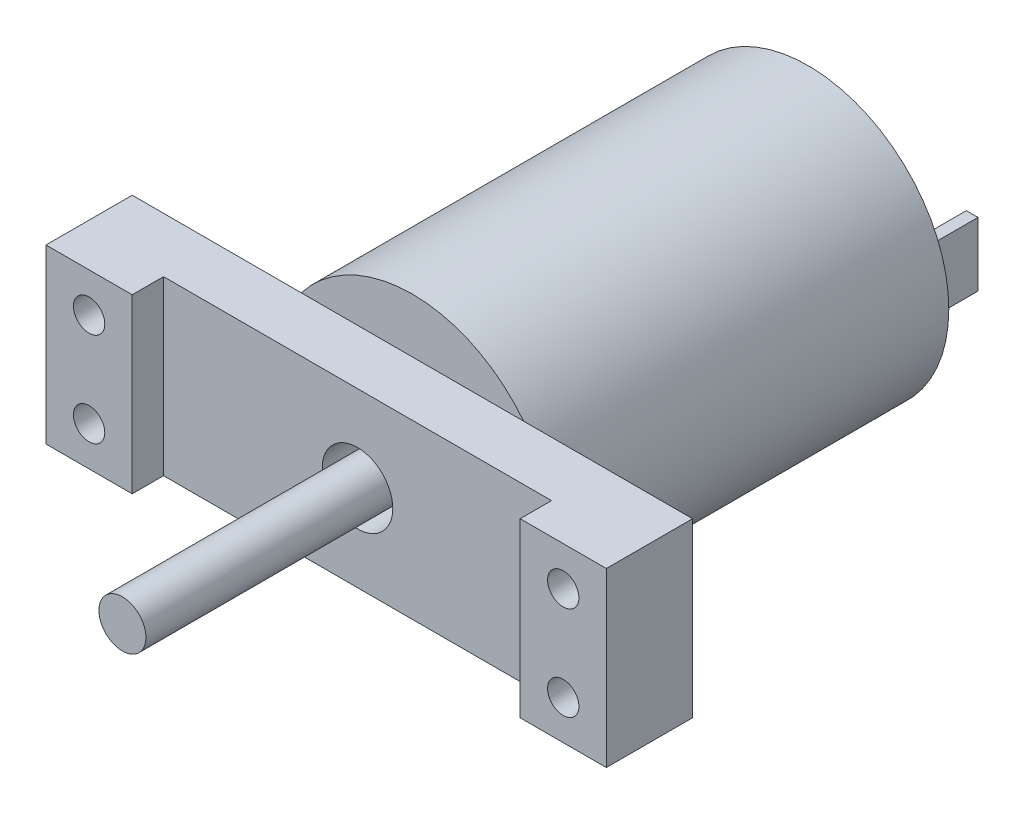
ISO-10303-21;
HEADER;
FILE_DESCRIPTION(('STEP AP214'),'2;1');
FILE_NAME('part.step','',(''),(''),'','','');
FILE_SCHEMA(('AUTOMOTIVE_DESIGN { 1 0 10303 214 1 1 1 1 }'));
ENDSEC;
DATA;
#1=APPLICATION_CONTEXT('core data for automotive mechanical design processes');
#2=APPLICATION_PROTOCOL_DEFINITION('international standard','automotive_design',2000,#1);
#3=PRODUCT_CONTEXT('',#1,'mechanical');
#4=PRODUCT('Part','Part','',(#3));
#5=PRODUCT_RELATED_PRODUCT_CATEGORY('part','',(#4));
#6=PRODUCT_DEFINITION_FORMATION('','',#4);
#7=PRODUCT_DEFINITION_CONTEXT('part definition',#1,'design');
#8=PRODUCT_DEFINITION('design','',#6,#7);
#9=PRODUCT_DEFINITION_SHAPE('','',#8);
#10=(LENGTH_UNIT() NAMED_UNIT(*) SI_UNIT(.MILLI.,.METRE.));
#11=(NAMED_UNIT(*) PLANE_ANGLE_UNIT() SI_UNIT($,.RADIAN.));
#12=(NAMED_UNIT(*) SI_UNIT($,.STERADIAN.) SOLID_ANGLE_UNIT());
#13=UNCERTAINTY_MEASURE_WITH_UNIT(LENGTH_MEASURE(1.E-05),#10,'distance_accuracy_value','');
#14=(GEOMETRIC_REPRESENTATION_CONTEXT(3) GLOBAL_UNCERTAINTY_ASSIGNED_CONTEXT((#13)) GLOBAL_UNIT_ASSIGNED_CONTEXT((#10,
#11,#12)) REPRESENTATION_CONTEXT('',''));
#15=CARTESIAN_POINT('',(0.,0.,0.));
#16=DIRECTION('',(0.,0.,1.));
#17=DIRECTION('',(1.,0.,0.));
#18=AXIS2_PLACEMENT_3D('',#15,#16,#17);
#19=CARTESIAN_POINT('',(0.,0.,0.));
#20=DIRECTION('',(0.,0.,1.));
#21=DIRECTION('',(1.,0.,0.));
#22=AXIS2_PLACEMENT_3D('',#19,#20,#21);
#23=PLANE('',#22);
#24=DIRECTION('',(0.,-1.,0.));
#25=VECTOR('',#24,1.);
#26=CARTESIAN_POINT('',(14.674642842713,5.01006528771067,0.));
#27=LINE('',#26,#25);
#28=CARTESIAN_POINT('',(14.674642842713,5.01006528771067,0.));
#29=VERTEX_POINT('',#28);
#30=CARTESIAN_POINT('',(14.674642842713,-3.1353311800507,0.));
#31=VERTEX_POINT('',#30);
#32=EDGE_CURVE('E179',#29,#31,#27,.T.);
#33=ORIENTED_EDGE('',*,*,#32,.F.);
#34=DIRECTION('',(1.,0.,0.));
#35=VECTOR('',#34,1.);
#36=CARTESIAN_POINT('',(14.674642842713,5.01006528771067,0.));
#37=LINE('',#36,#35);
#38=CARTESIAN_POINT('',(13.1877847573279,5.01006528771067,0.));
#39=VERTEX_POINT('',#38);
#40=EDGE_CURVE('E192',#39,#29,#37,.T.);
#41=ORIENTED_EDGE('',*,*,#40,.F.);
#42=DIRECTION('',(0.,1.,0.));
#43=VECTOR('',#42,1.);
#44=CARTESIAN_POINT('',(13.1877847573279,5.01006528771067,0.));
#45=LINE('',#44,#43);
#46=CARTESIAN_POINT('',(13.1877847573279,-3.1353311800507,0.));
#47=VERTEX_POINT('',#46);
#48=EDGE_CURVE('E201',#47,#39,#45,.T.);
#49=ORIENTED_EDGE('',*,*,#48,.F.);
#50=DIRECTION('',(-1.,0.,0.));
#51=VECTOR('',#50,1.);
#52=CARTESIAN_POINT('',(14.674642842713,-3.1353311800507,0.));
#53=LINE('',#52,#51);
#54=EDGE_CURVE('E182',#31,#47,#53,.T.);
#55=ORIENTED_EDGE('',*,*,#54,.F.);
#56=EDGE_LOOP('',(#33,#41,#49,#55));
#57=FACE_BOUND('',#56,.T.);
#58=CARTESIAN_POINT('',(0.,0.,0.));
#59=DIRECTION('',(0.,0.,1.));
#60=DIRECTION('',(1.,0.,0.));
#61=AXIS2_PLACEMENT_3D('',#58,#59,#60);
#62=CIRCLE('',#61,17.95);
#63=CARTESIAN_POINT('',(17.95,0.,0.));
#64=VERTEX_POINT('',#63);
#65=EDGE_CURVE('E313',#64,#64,#62,.T.);
#66=ORIENTED_EDGE('',*,*,#65,.F.);
#67=EDGE_LOOP('',(#66));
#68=FACE_BOUND('',#67,.T.);
#69=DIRECTION('',(0.,-1.,0.));
#70=VECTOR('',#69,1.);
#71=CARTESIAN_POINT('',(-12.1534486979297,5.01006528771067,0.));
#72=LINE('',#71,#70);
#73=CARTESIAN_POINT('',(-12.1534486979297,5.01006528771067,0.));
#74=VERTEX_POINT('',#73);
#75=CARTESIAN_POINT('',(-12.1534486979297,-3.1353311800507,0.));
#76=VERTEX_POINT('',#75);
#77=EDGE_CURVE('E178',#74,#76,#72,.T.);
#78=ORIENTED_EDGE('',*,*,#77,.F.);
#79=DIRECTION('',(1.,0.,0.));
#80=VECTOR('',#79,1.);
#81=CARTESIAN_POINT('',(-12.1534486979297,5.01006528771067,0.));
#82=LINE('',#81,#80);
#83=CARTESIAN_POINT('',(-14.028182805589,5.01006528771067,0.));
#84=VERTEX_POINT('',#83);
#85=EDGE_CURVE('E175',#84,#74,#82,.T.);
#86=ORIENTED_EDGE('',*,*,#85,.F.);
#87=DIRECTION('',(0.,1.,0.));
#88=VECTOR('',#87,1.);
#89=CARTESIAN_POINT('',(-14.028182805589,5.01006528771067,0.));
#90=LINE('',#89,#88);
#91=CARTESIAN_POINT('',(-14.028182805589,-3.1353311800507,0.));
#92=VERTEX_POINT('',#91);
#93=EDGE_CURVE('E53',#92,#84,#90,.T.);
#94=ORIENTED_EDGE('',*,*,#93,.F.);
#95=DIRECTION('',(-1.,0.,0.));
#96=VECTOR('',#95,1.);
#97=CARTESIAN_POINT('',(-12.1534486979297,-3.1353311800507,0.));
#98=LINE('',#97,#96);
#99=EDGE_CURVE('E48',#76,#92,#98,.T.);
#100=ORIENTED_EDGE('',*,*,#99,.F.);
#101=EDGE_LOOP('',(#78,#86,#94,#100));
#102=FACE_BOUND('',#101,.T.);
#103=ADVANCED_FACE('F33',(#57,#68,#102),#23,.F.);
#104=CARTESIAN_POINT('',(0.,0.,57.5));
#105=DIRECTION('',(0.,0.,-1.));
#106=DIRECTION('',(-1.,0.,0.));
#107=AXIS2_PLACEMENT_3D('',#104,#105,#106);
#108=PLANE('',#107);
#109=CARTESIAN_POINT('',(0.,0.,57.5));
#110=DIRECTION('',(0.,0.,1.));
#111=DIRECTION('',(1.,0.,0.));
#112=AXIS2_PLACEMENT_3D('',#109,#110,#111);
#113=CIRCLE('',#112,4.5);
#114=CARTESIAN_POINT('',(4.5,0.,57.5));
#115=VERTEX_POINT('',#114);
#116=EDGE_CURVE('E279',#115,#115,#113,.T.);
#117=ORIENTED_EDGE('',*,*,#116,.F.);
#118=EDGE_LOOP('',(#117));
#119=FACE_BOUND('',#118,.T.);
#120=DIRECTION('',(0.,-1.,0.));
#121=VECTOR('',#120,1.);
#122=CARTESIAN_POINT('',(24.75,11.,57.5));
#123=LINE('',#122,#121);
#124=CARTESIAN_POINT('',(24.75,11.,57.5));
#125=VERTEX_POINT('',#124);
#126=CARTESIAN_POINT('',(24.75,-11.,57.5));
#127=VERTEX_POINT('',#126);
#128=EDGE_CURVE('E241',#125,#127,#123,.T.);
#129=ORIENTED_EDGE('',*,*,#128,.F.);
#130=DIRECTION('',(-1.,0.,0.));
#131=VECTOR('',#130,1.);
#132=CARTESIAN_POINT('',(-35.75,11.,57.5));
#133=LINE('',#132,#131);
#134=CARTESIAN_POINT('',(-24.75,11.,57.5));
#135=VERTEX_POINT('',#134);
#136=EDGE_CURVE('E285',#125,#135,#133,.T.);
#137=ORIENTED_EDGE('',*,*,#136,.T.);
#138=DIRECTION('',(0.,1.,0.));
#139=VECTOR('',#138,1.);
#140=CARTESIAN_POINT('',(-24.75,11.,57.5));
#141=LINE('',#140,#139);
#142=CARTESIAN_POINT('',(-24.75,-11.,57.5));
#143=VERTEX_POINT('',#142);
#144=EDGE_CURVE('E260',#143,#135,#141,.T.);
#145=ORIENTED_EDGE('',*,*,#144,.F.);
#146=DIRECTION('',(1.,0.,0.));
#147=VECTOR('',#146,1.);
#148=CARTESIAN_POINT('',(-35.75,-11.,57.5));
#149=LINE('',#148,#147);
#150=EDGE_CURVE('E283',#143,#127,#149,.T.);
#151=ORIENTED_EDGE('',*,*,#150,.T.);
#152=EDGE_LOOP('',(#129,#137,#145,#151));
#153=FACE_BOUND('',#152,.T.);
#154=ADVANCED_FACE('F364',(#119,#153),#108,.F.);
#155=CARTESIAN_POINT('',(0.,0.,50.5));
#156=DIRECTION('',(0.,0.,1.));
#157=DIRECTION('',(1.,0.,0.));
#158=AXIS2_PLACEMENT_3D('',#155,#156,#157);
#159=PLANE('',#158);
#160=CARTESIAN_POINT('',(0.,0.,50.5));
#161=DIRECTION('',(0.,0.,1.));
#162=DIRECTION('',(1.,0.,0.));
#163=AXIS2_PLACEMENT_3D('',#160,#161,#162);
#164=CIRCLE('',#163,3.);
#165=CARTESIAN_POINT('',(3.,0.,50.5));
#166=VERTEX_POINT('',#165);
#167=EDGE_CURVE('E314',#166,#166,#164,.T.);
#168=ORIENTED_EDGE('',*,*,#167,.F.);
#169=EDGE_LOOP('',(#168));
#170=FACE_BOUND('',#169,.T.);
#171=CARTESIAN_POINT('',(0.,0.,50.5));
#172=DIRECTION('',(0.,0.,1.));
#173=DIRECTION('',(1.,0.,0.));
#174=AXIS2_PLACEMENT_3D('',#171,#172,#173);
#175=CIRCLE('',#174,4.5);
#176=CARTESIAN_POINT('',(4.5,0.,50.5));
#177=VERTEX_POINT('',#176);
#178=EDGE_CURVE('E317',#177,#177,#175,.F.);
#179=ORIENTED_EDGE('',*,*,#178,.F.);
#180=EDGE_LOOP('',(#179));
#181=FACE_BOUND('',#180,.T.);
#182=ADVANCED_FACE('F353',(#170,#181),#159,.T.);
#183=CARTESIAN_POINT('',(0.,0.,87.5));
#184=DIRECTION('',(0.,0.,-1.));
#185=DIRECTION('',(-1.,0.,0.));
#186=AXIS2_PLACEMENT_3D('',#183,#184,#185);
#187=CYLINDRICAL_SURFACE('',#186,3.);
#188=CARTESIAN_POINT('',(0.,0.,87.5));
#189=DIRECTION('',(0.,0.,1.));
#190=DIRECTION('',(1.,0.,0.));
#191=AXIS2_PLACEMENT_3D('',#188,#189,#190);
#192=CIRCLE('',#191,3.);
#193=CARTESIAN_POINT('',(3.,0.,87.5));
#194=VERTEX_POINT('',#193);
#195=EDGE_CURVE('E310',#194,#194,#192,.T.);
#196=ORIENTED_EDGE('',*,*,#195,.F.);
#197=EDGE_LOOP('',(#196));
#198=FACE_BOUND('',#197,.T.);
#199=ORIENTED_EDGE('',*,*,#167,.T.);
#200=EDGE_LOOP('',(#199));
#201=FACE_BOUND('',#200,.T.);
#202=ADVANCED_FACE('F363',(#198,#201),#187,.T.);
#203=CARTESIAN_POINT('',(0.,0.,87.5));
#204=DIRECTION('',(0.,0.,1.));
#205=DIRECTION('',(1.,0.,0.));
#206=AXIS2_PLACEMENT_3D('',#203,#204,#205);
#207=PLANE('',#206);
#208=ORIENTED_EDGE('',*,*,#195,.T.);
#209=EDGE_LOOP('',(#208));
#210=FACE_BOUND('',#209,.T.);
#211=ADVANCED_FACE('F470',(#210),#207,.T.);
#212=CARTESIAN_POINT('',(0.,0.,50.5));
#213=DIRECTION('',(0.,0.,-1.));
#214=DIRECTION('',(-1.,0.,0.));
#215=AXIS2_PLACEMENT_3D('',#212,#213,#214);
#216=PLANE('',#215);
#217=CARTESIAN_POINT('',(30.25,6.,50.5));
#218=DIRECTION('',(0.,0.,-1.));
#219=DIRECTION('',(-1.,0.,0.));
#220=AXIS2_PLACEMENT_3D('',#217,#218,#219);
#221=CIRCLE('',#220,2.);
#222=CARTESIAN_POINT('',(28.25,6.,50.5));
#223=VERTEX_POINT('',#222);
#224=EDGE_CURVE('E229',#223,#223,#221,.F.);
#225=ORIENTED_EDGE('',*,*,#224,.T.);
#226=EDGE_LOOP('',(#225));
#227=FACE_BOUND('',#226,.T.);
#228=CARTESIAN_POINT('',(30.25,-6.,50.5));
#229=DIRECTION('',(0.,0.,-1.));
#230=DIRECTION('',(-1.,0.,0.));
#231=AXIS2_PLACEMENT_3D('',#228,#229,#230);
#232=CIRCLE('',#231,2.);
#233=CARTESIAN_POINT('',(28.25,-6.,50.5));
#234=VERTEX_POINT('',#233);
#235=EDGE_CURVE('E222',#234,#234,#232,.F.);
#236=ORIENTED_EDGE('',*,*,#235,.T.);
#237=EDGE_LOOP('',(#236));
#238=FACE_BOUND('',#237,.T.);
#239=CARTESIAN_POINT('',(0.,0.,50.5));
#240=DIRECTION('',(0.,0.,1.));
#241=DIRECTION('',(1.,0.,0.));
#242=AXIS2_PLACEMENT_3D('',#239,#240,#241);
#243=CIRCLE('',#242,17.95);
#244=CARTESIAN_POINT('',(14.1845867052939,-11.,50.5));
#245=VERTEX_POINT('',#244);
#246=CARTESIAN_POINT('',(14.1845867052939,11.,50.5));
#247=VERTEX_POINT('',#246);
#248=EDGE_CURVE('E322',#245,#247,#243,.T.);
#249=ORIENTED_EDGE('',*,*,#248,.T.);
#250=DIRECTION('',(-1.,0.,0.));
#251=VECTOR('',#250,1.);
#252=CARTESIAN_POINT('',(-35.75,11.,50.5));
#253=LINE('',#252,#251);
#254=CARTESIAN_POINT('',(35.75,11.,50.5));
#255=VERTEX_POINT('',#254);
#256=EDGE_CURVE('E286',#255,#247,#253,.T.);
#257=ORIENTED_EDGE('',*,*,#256,.F.);
#258=DIRECTION('',(0.,1.,0.));
#259=VECTOR('',#258,1.);
#260=CARTESIAN_POINT('',(35.75,-11.,50.5));
#261=LINE('',#260,#259);
#262=CARTESIAN_POINT('',(35.75,-11.,50.5));
#263=VERTEX_POINT('',#262);
#264=EDGE_CURVE('E295',#263,#255,#261,.T.);
#265=ORIENTED_EDGE('',*,*,#264,.F.);
#266=DIRECTION('',(1.,0.,0.));
#267=VECTOR('',#266,1.);
#268=CARTESIAN_POINT('',(-35.75,-11.,50.5));
#269=LINE('',#268,#267);
#270=EDGE_CURVE('E291',#245,#263,#269,.T.);
#271=ORIENTED_EDGE('',*,*,#270,.F.);
#272=EDGE_LOOP('',(#249,#257,#265,#271));
#273=FACE_BOUND('',#272,.T.);
#274=ADVANCED_FACE('F344',(#227,#238,#273),#216,.T.);
#275=CARTESIAN_POINT('',(-30.25,-6.,50.5));
#276=DIRECTION('',(0.,0.,-1.));
#277=DIRECTION('',(-1.,0.,0.));
#278=AXIS2_PLACEMENT_3D('',#275,#276,#277);
#279=CIRCLE('',#278,2.);
#280=CARTESIAN_POINT('',(-32.25,-6.,50.5));
#281=VERTEX_POINT('',#280);
#282=EDGE_CURVE('E221',#281,#281,#279,.F.);
#283=ORIENTED_EDGE('',*,*,#282,.T.);
#284=EDGE_LOOP('',(#283));
#285=FACE_BOUND('',#284,.T.);
#286=CARTESIAN_POINT('',(-30.25,6.,50.5));
#287=DIRECTION('',(0.,0.,-1.));
#288=DIRECTION('',(-1.,0.,0.));
#289=AXIS2_PLACEMENT_3D('',#286,#287,#288);
#290=CIRCLE('',#289,2.);
#291=CARTESIAN_POINT('',(-32.25,6.,50.5));
#292=VERTEX_POINT('',#291);
#293=EDGE_CURVE('E238',#292,#292,#290,.F.);
#294=ORIENTED_EDGE('',*,*,#293,.T.);
#295=EDGE_LOOP('',(#294));
#296=FACE_BOUND('',#295,.T.);
#297=CARTESIAN_POINT('',(-14.1845867052939,11.,50.5));
#298=VERTEX_POINT('',#297);
#299=CARTESIAN_POINT('',(-14.1845867052939,-11.,50.5));
#300=VERTEX_POINT('',#299);
#301=EDGE_CURVE('E321',#298,#300,#243,.T.);
#302=ORIENTED_EDGE('',*,*,#301,.T.);
#303=CARTESIAN_POINT('',(-35.75,-11.,50.5));
#304=VERTEX_POINT('',#303);
#305=EDGE_CURVE('E292',#304,#300,#269,.T.);
#306=ORIENTED_EDGE('',*,*,#305,.F.);
#307=DIRECTION('',(0.,-1.,0.));
#308=VECTOR('',#307,1.);
#309=CARTESIAN_POINT('',(-35.75,-11.,50.5));
#310=LINE('',#309,#308);
#311=CARTESIAN_POINT('',(-35.75,11.,50.5));
#312=VERTEX_POINT('',#311);
#313=EDGE_CURVE('E282',#312,#304,#310,.T.);
#314=ORIENTED_EDGE('',*,*,#313,.F.);
#315=EDGE_CURVE('E297',#298,#312,#253,.T.);
#316=ORIENTED_EDGE('',*,*,#315,.F.);
#317=EDGE_LOOP('',(#302,#306,#314,#316));
#318=FACE_BOUND('',#317,.T.);
#319=ADVANCED_FACE('F454',(#285,#296,#318),#216,.T.);
#320=CARTESIAN_POINT('',(-35.75,-11.,57.5));
#321=DIRECTION('',(1.,0.,0.));
#322=DIRECTION('',(0.,0.,-1.));
#323=AXIS2_PLACEMENT_3D('',#320,#321,#322);
#324=PLANE('',#323);
#325=ORIENTED_EDGE('',*,*,#313,.T.);
#326=DIRECTION('',(0.,0.,-1.));
#327=VECTOR('',#326,1.);
#328=CARTESIAN_POINT('',(-35.75,-11.,57.5));
#329=LINE('',#328,#327);
#330=CARTESIAN_POINT('',(-35.75,-11.,61.5));
#331=VERTEX_POINT('',#330);
#332=EDGE_CURVE('E307',#331,#304,#329,.T.);
#333=ORIENTED_EDGE('',*,*,#332,.F.);
#334=DIRECTION('',(0.,-1.,0.));
#335=VECTOR('',#334,1.);
#336=CARTESIAN_POINT('',(-35.75,11.,61.5));
#337=LINE('',#336,#335);
#338=CARTESIAN_POINT('',(-35.75,11.,61.5));
#339=VERTEX_POINT('',#338);
#340=EDGE_CURVE('E261',#339,#331,#337,.T.);
#341=ORIENTED_EDGE('',*,*,#340,.F.);
#342=DIRECTION('',(0.,0.,-1.));
#343=VECTOR('',#342,1.);
#344=CARTESIAN_POINT('',(-35.75,11.,57.5));
#345=LINE('',#344,#343);
#346=EDGE_CURVE('E288',#339,#312,#345,.T.);
#347=ORIENTED_EDGE('',*,*,#346,.T.);
#348=EDGE_LOOP('',(#325,#333,#341,#347));
#349=FACE_BOUND('',#348,.T.);
#350=ADVANCED_FACE('F457',(#349),#324,.F.);
#351=CARTESIAN_POINT('',(-35.75,-11.,57.5));
#352=DIRECTION('',(0.,1.,0.));
#353=DIRECTION('',(0.,0.,1.));
#354=AXIS2_PLACEMENT_3D('',#351,#352,#353);
#355=PLANE('',#354);
#356=ORIENTED_EDGE('',*,*,#305,.T.);
#357=DIRECTION('',(-1.,0.,0.));
#358=VECTOR('',#357,1.);
#359=CARTESIAN_POINT('',(0.,-11.,50.5));
#360=LINE('',#359,#358);
#361=EDGE_CURVE('E11',#245,#300,#360,.T.);
#362=ORIENTED_EDGE('',*,*,#361,.F.);
#363=ORIENTED_EDGE('',*,*,#270,.T.);
#364=DIRECTION('',(0.,0.,-1.));
#365=VECTOR('',#364,1.);
#366=CARTESIAN_POINT('',(35.75,-11.,57.5));
#367=LINE('',#366,#365);
#368=CARTESIAN_POINT('',(35.75,-11.,61.5));
#369=VERTEX_POINT('',#368);
#370=EDGE_CURVE('E304',#369,#263,#367,.T.);
#371=ORIENTED_EDGE('',*,*,#370,.F.);
#372=DIRECTION('',(1.,0.,0.));
#373=VECTOR('',#372,1.);
#374=CARTESIAN_POINT('',(35.75,-11.,61.5));
#375=LINE('',#374,#373);
#376=CARTESIAN_POINT('',(24.75,-11.,61.5));
#377=VERTEX_POINT('',#376);
#378=EDGE_CURVE('E249',#377,#369,#375,.T.);
#379=ORIENTED_EDGE('',*,*,#378,.F.);
#380=DIRECTION('',(0.,0.,-1.));
#381=VECTOR('',#380,1.);
#382=CARTESIAN_POINT('',(24.75,-11.,61.5));
#383=LINE('',#382,#381);
#384=EDGE_CURVE('E252',#377,#127,#383,.T.);
#385=ORIENTED_EDGE('',*,*,#384,.T.);
#386=ORIENTED_EDGE('',*,*,#150,.F.);
#387=DIRECTION('',(0.,0.,-1.));
#388=VECTOR('',#387,1.);
#389=CARTESIAN_POINT('',(-24.75,-11.,61.5));
#390=LINE('',#389,#388);
#391=CARTESIAN_POINT('',(-24.75,-11.,61.5));
#392=VERTEX_POINT('',#391);
#393=EDGE_CURVE('E276',#392,#143,#390,.T.);
#394=ORIENTED_EDGE('',*,*,#393,.F.);
#395=DIRECTION('',(1.,0.,0.));
#396=VECTOR('',#395,1.);
#397=CARTESIAN_POINT('',(-35.75,-11.,61.5));
#398=LINE('',#397,#396);
#399=EDGE_CURVE('E264',#331,#392,#398,.T.);
#400=ORIENTED_EDGE('',*,*,#399,.F.);
#401=ORIENTED_EDGE('',*,*,#332,.T.);
#402=EDGE_LOOP('',(#356,#362,#363,#371,#379,#385,#386,#394,#400,#401));
#403=FACE_BOUND('',#402,.T.);
#404=ADVANCED_FACE('F348',(#403),#355,.F.);
#405=CARTESIAN_POINT('',(35.75,-11.,57.5));
#406=DIRECTION('',(-1.,0.,0.));
#407=DIRECTION('',(0.,0.,1.));
#408=AXIS2_PLACEMENT_3D('',#405,#406,#407);
#409=PLANE('',#408);
#410=ORIENTED_EDGE('',*,*,#264,.T.);
#411=DIRECTION('',(0.,0.,-1.));
#412=VECTOR('',#411,1.);
#413=CARTESIAN_POINT('',(35.75,11.,57.5));
#414=LINE('',#413,#412);
#415=CARTESIAN_POINT('',(35.75,11.,61.5));
#416=VERTEX_POINT('',#415);
#417=EDGE_CURVE('E301',#416,#255,#414,.T.);
#418=ORIENTED_EDGE('',*,*,#417,.F.);
#419=DIRECTION('',(0.,1.,0.));
#420=VECTOR('',#419,1.);
#421=CARTESIAN_POINT('',(35.75,11.,61.5));
#422=LINE('',#421,#420);
#423=EDGE_CURVE('E242',#369,#416,#422,.T.);
#424=ORIENTED_EDGE('',*,*,#423,.F.);
#425=ORIENTED_EDGE('',*,*,#370,.T.);
#426=EDGE_LOOP('',(#410,#418,#424,#425));
#427=FACE_BOUND('',#426,.T.);
#428=ADVANCED_FACE('F461',(#427),#409,.F.);
#429=CARTESIAN_POINT('',(-35.75,11.,57.5));
#430=DIRECTION('',(0.,-1.,0.));
#431=DIRECTION('',(0.,0.,-1.));
#432=AXIS2_PLACEMENT_3D('',#429,#430,#431);
#433=PLANE('',#432);
#434=ORIENTED_EDGE('',*,*,#256,.T.);
#435=DIRECTION('',(1.,0.,0.));
#436=VECTOR('',#435,1.);
#437=CARTESIAN_POINT('',(0.,11.,50.5));
#438=LINE('',#437,#436);
#439=EDGE_CURVE('E41',#298,#247,#438,.T.);
#440=ORIENTED_EDGE('',*,*,#439,.F.);
#441=ORIENTED_EDGE('',*,*,#315,.T.);
#442=ORIENTED_EDGE('',*,*,#346,.F.);
#443=DIRECTION('',(-1.,0.,0.));
#444=VECTOR('',#443,1.);
#445=CARTESIAN_POINT('',(-35.75,11.,61.5));
#446=LINE('',#445,#444);
#447=CARTESIAN_POINT('',(-24.75,11.,61.5));
#448=VERTEX_POINT('',#447);
#449=EDGE_CURVE('E268',#448,#339,#446,.T.);
#450=ORIENTED_EDGE('',*,*,#449,.F.);
#451=DIRECTION('',(0.,0.,-1.));
#452=VECTOR('',#451,1.);
#453=CARTESIAN_POINT('',(-24.75,11.,61.5));
#454=LINE('',#453,#452);
#455=EDGE_CURVE('E271',#448,#135,#454,.T.);
#456=ORIENTED_EDGE('',*,*,#455,.T.);
#457=ORIENTED_EDGE('',*,*,#136,.F.);
#458=DIRECTION('',(0.,0.,-1.));
#459=VECTOR('',#458,1.);
#460=CARTESIAN_POINT('',(24.75,11.,61.5));
#461=LINE('',#460,#459);
#462=CARTESIAN_POINT('',(24.75,11.,61.5));
#463=VERTEX_POINT('',#462);
#464=EDGE_CURVE('E257',#463,#125,#461,.T.);
#465=ORIENTED_EDGE('',*,*,#464,.F.);
#466=DIRECTION('',(-1.,0.,0.));
#467=VECTOR('',#466,1.);
#468=CARTESIAN_POINT('',(35.75,11.,61.5));
#469=LINE('',#468,#467);
#470=EDGE_CURVE('E245',#416,#463,#469,.T.);
#471=ORIENTED_EDGE('',*,*,#470,.F.);
#472=ORIENTED_EDGE('',*,*,#417,.T.);
#473=EDGE_LOOP('',(#434,#440,#441,#442,#450,#456,#457,#465,#471,#472));
#474=FACE_BOUND('',#473,.T.);
#475=ADVANCED_FACE('F358',(#474),#433,.F.);
#476=CARTESIAN_POINT('',(0.,0.,57.5));
#477=DIRECTION('',(0.,0.,-1.));
#478=DIRECTION('',(-1.,0.,0.));
#479=AXIS2_PLACEMENT_3D('',#476,#477,#478);
#480=CYLINDRICAL_SURFACE('',#479,4.5);
#481=ORIENTED_EDGE('',*,*,#116,.T.);
#482=EDGE_LOOP('',(#481));
#483=FACE_BOUND('',#482,.T.);
#484=ORIENTED_EDGE('',*,*,#178,.T.);
#485=EDGE_LOOP('',(#484));
#486=FACE_BOUND('',#485,.T.);
#487=ADVANCED_FACE('F351',(#483,#486),#480,.F.);
#488=EDGE_CURVE('E339',#300,#245,#243,.T.);
#489=ORIENTED_EDGE('',*,*,#488,.T.);
#490=ORIENTED_EDGE('',*,*,#361,.T.);
#491=EDGE_LOOP('',(#489,#490));
#492=FACE_BOUND('',#491,.T.);
#493=ADVANCED_FACE('F349',(#492),#159,.T.);
#494=EDGE_CURVE('E318',#247,#298,#243,.T.);
#495=ORIENTED_EDGE('',*,*,#494,.T.);
#496=ORIENTED_EDGE('',*,*,#439,.T.);
#497=EDGE_LOOP('',(#495,#496));
#498=FACE_BOUND('',#497,.T.);
#499=ADVANCED_FACE('F330',(#498),#159,.T.);
#500=CARTESIAN_POINT('',(0.,0.,50.5));
#501=DIRECTION('',(0.,0.,-1.));
#502=DIRECTION('',(-1.,0.,0.));
#503=AXIS2_PLACEMENT_3D('',#500,#501,#502);
#504=CYLINDRICAL_SURFACE('',#503,17.95);
#505=ORIENTED_EDGE('',*,*,#494,.F.);
#506=ORIENTED_EDGE('',*,*,#248,.F.);
#507=ORIENTED_EDGE('',*,*,#488,.F.);
#508=ORIENTED_EDGE('',*,*,#301,.F.);
#509=EDGE_LOOP('',(#505,#506,#507,#508));
#510=FACE_BOUND('',#509,.T.);
#511=ORIENTED_EDGE('',*,*,#65,.T.);
#512=EDGE_LOOP('',(#511));
#513=FACE_BOUND('',#512,.T.);
#514=ADVANCED_FACE('F35',(#510,#513),#504,.T.);
#515=CARTESIAN_POINT('',(-24.75,11.,61.5));
#516=DIRECTION('',(-1.,0.,0.));
#517=DIRECTION('',(0.,0.,1.));
#518=AXIS2_PLACEMENT_3D('',#515,#516,#517);
#519=PLANE('',#518);
#520=ORIENTED_EDGE('',*,*,#144,.T.);
#521=ORIENTED_EDGE('',*,*,#455,.F.);
#522=DIRECTION('',(0.,1.,0.));
#523=VECTOR('',#522,1.);
#524=CARTESIAN_POINT('',(-24.75,11.,61.5));
#525=LINE('',#524,#523);
#526=EDGE_CURVE('E266',#392,#448,#525,.T.);
#527=ORIENTED_EDGE('',*,*,#526,.F.);
#528=ORIENTED_EDGE('',*,*,#393,.T.);
#529=EDGE_LOOP('',(#520,#521,#527,#528));
#530=FACE_BOUND('',#529,.T.);
#531=ADVANCED_FACE('F449',(#530),#519,.F.);
#532=CARTESIAN_POINT('',(0.,0.,61.5));
#533=DIRECTION('',(0.,0.,1.));
#534=DIRECTION('',(1.,0.,0.));
#535=AXIS2_PLACEMENT_3D('',#532,#533,#534);
#536=PLANE('',#535);
#537=CARTESIAN_POINT('',(-30.25,-6.,61.5));
#538=DIRECTION('',(0.,0.,1.));
#539=DIRECTION('',(1.,0.,0.));
#540=AXIS2_PLACEMENT_3D('',#537,#538,#539);
#541=CIRCLE('',#540,2.);
#542=CARTESIAN_POINT('',(-28.25,-6.,61.5));
#543=VERTEX_POINT('',#542);
#544=EDGE_CURVE('E218',#543,#543,#541,.T.);
#545=ORIENTED_EDGE('',*,*,#544,.F.);
#546=EDGE_LOOP('',(#545));
#547=FACE_BOUND('',#546,.T.);
#548=CARTESIAN_POINT('',(-30.25,6.,61.5));
#549=DIRECTION('',(0.,0.,1.));
#550=DIRECTION('',(1.,0.,0.));
#551=AXIS2_PLACEMENT_3D('',#548,#549,#550);
#552=CIRCLE('',#551,2.);
#553=CARTESIAN_POINT('',(-28.25,6.,61.5));
#554=VERTEX_POINT('',#553);
#555=EDGE_CURVE('E225',#554,#554,#552,.T.);
#556=ORIENTED_EDGE('',*,*,#555,.F.);
#557=EDGE_LOOP('',(#556));
#558=FACE_BOUND('',#557,.T.);
#559=ORIENTED_EDGE('',*,*,#340,.T.);
#560=ORIENTED_EDGE('',*,*,#399,.T.);
#561=ORIENTED_EDGE('',*,*,#526,.T.);
#562=ORIENTED_EDGE('',*,*,#449,.T.);
#563=EDGE_LOOP('',(#559,#560,#561,#562));
#564=FACE_BOUND('',#563,.T.);
#565=ADVANCED_FACE('F445',(#547,#558,#564),#536,.T.);
#566=CARTESIAN_POINT('',(24.75,11.,61.5));
#567=DIRECTION('',(1.,0.,0.));
#568=DIRECTION('',(0.,0.,-1.));
#569=AXIS2_PLACEMENT_3D('',#566,#567,#568);
#570=PLANE('',#569);
#571=ORIENTED_EDGE('',*,*,#128,.T.);
#572=ORIENTED_EDGE('',*,*,#384,.F.);
#573=DIRECTION('',(0.,-1.,0.));
#574=VECTOR('',#573,1.);
#575=CARTESIAN_POINT('',(24.75,11.,61.5));
#576=LINE('',#575,#574);
#577=EDGE_CURVE('E247',#463,#377,#576,.T.);
#578=ORIENTED_EDGE('',*,*,#577,.F.);
#579=ORIENTED_EDGE('',*,*,#464,.T.);
#580=EDGE_LOOP('',(#571,#572,#578,#579));
#581=FACE_BOUND('',#580,.T.);
#582=ADVANCED_FACE('F441',(#581),#570,.F.);
#583=CARTESIAN_POINT('',(0.,0.,61.5));
#584=DIRECTION('',(0.,0.,-1.));
#585=DIRECTION('',(-1.,0.,0.));
#586=AXIS2_PLACEMENT_3D('',#583,#584,#585);
#587=PLANE('',#586);
#588=CARTESIAN_POINT('',(30.25,6.,61.5));
#589=DIRECTION('',(0.,0.,1.));
#590=DIRECTION('',(1.,0.,0.));
#591=AXIS2_PLACEMENT_3D('',#588,#589,#590);
#592=CIRCLE('',#591,2.);
#593=CARTESIAN_POINT('',(32.25,6.,61.5));
#594=VERTEX_POINT('',#593);
#595=EDGE_CURVE('E217',#594,#594,#592,.T.);
#596=ORIENTED_EDGE('',*,*,#595,.F.);
#597=EDGE_LOOP('',(#596));
#598=FACE_BOUND('',#597,.T.);
#599=CARTESIAN_POINT('',(30.25,-6.,61.5));
#600=DIRECTION('',(0.,0.,1.));
#601=DIRECTION('',(1.,0.,0.));
#602=AXIS2_PLACEMENT_3D('',#599,#600,#601);
#603=CIRCLE('',#602,2.);
#604=CARTESIAN_POINT('',(32.25,-6.,61.5));
#605=VERTEX_POINT('',#604);
#606=EDGE_CURVE('E226',#605,#605,#603,.T.);
#607=ORIENTED_EDGE('',*,*,#606,.F.);
#608=EDGE_LOOP('',(#607));
#609=FACE_BOUND('',#608,.T.);
#610=ORIENTED_EDGE('',*,*,#423,.T.);
#611=ORIENTED_EDGE('',*,*,#470,.T.);
#612=ORIENTED_EDGE('',*,*,#577,.T.);
#613=ORIENTED_EDGE('',*,*,#378,.T.);
#614=EDGE_LOOP('',(#610,#611,#612,#613));
#615=FACE_BOUND('',#614,.T.);
#616=ADVANCED_FACE('F431',(#598,#609,#615),#587,.F.);
#617=CARTESIAN_POINT('',(30.25,-6.,44.8431457505076));
#618=DIRECTION('',(0.,0.,1.));
#619=DIRECTION('',(1.,0.,0.));
#620=AXIS2_PLACEMENT_3D('',#617,#618,#619);
#621=CYLINDRICAL_SURFACE('',#620,2.);
#622=ORIENTED_EDGE('',*,*,#606,.T.);
#623=EDGE_LOOP('',(#622));
#624=FACE_BOUND('',#623,.T.);
#625=ORIENTED_EDGE('',*,*,#235,.F.);
#626=EDGE_LOOP('',(#625));
#627=FACE_BOUND('',#626,.T.);
#628=ADVANCED_FACE('F427',(#624,#627),#621,.F.);
#629=CARTESIAN_POINT('',(30.25,6.,44.8431457505076));
#630=DIRECTION('',(0.,0.,1.));
#631=DIRECTION('',(1.,0.,0.));
#632=AXIS2_PLACEMENT_3D('',#629,#630,#631);
#633=CYLINDRICAL_SURFACE('',#632,2.);
#634=ORIENTED_EDGE('',*,*,#595,.T.);
#635=EDGE_LOOP('',(#634));
#636=FACE_BOUND('',#635,.T.);
#637=ORIENTED_EDGE('',*,*,#224,.F.);
#638=EDGE_LOOP('',(#637));
#639=FACE_BOUND('',#638,.T.);
#640=ADVANCED_FACE('F430',(#636,#639),#633,.F.);
#641=CARTESIAN_POINT('',(-30.25,6.,44.8431457505076));
#642=DIRECTION('',(0.,0.,1.));
#643=DIRECTION('',(1.,0.,0.));
#644=AXIS2_PLACEMENT_3D('',#641,#642,#643);
#645=CYLINDRICAL_SURFACE('',#644,2.);
#646=ORIENTED_EDGE('',*,*,#555,.T.);
#647=EDGE_LOOP('',(#646));
#648=FACE_BOUND('',#647,.T.);
#649=ORIENTED_EDGE('',*,*,#293,.F.);
#650=EDGE_LOOP('',(#649));
#651=FACE_BOUND('',#650,.T.);
#652=ADVANCED_FACE('F425',(#648,#651),#645,.F.);
#653=CARTESIAN_POINT('',(-30.25,-6.,44.8431457505076));
#654=DIRECTION('',(0.,0.,1.));
#655=DIRECTION('',(1.,0.,0.));
#656=AXIS2_PLACEMENT_3D('',#653,#654,#655);
#657=CYLINDRICAL_SURFACE('',#656,2.);
#658=ORIENTED_EDGE('',*,*,#544,.T.);
#659=EDGE_LOOP('',(#658));
#660=FACE_BOUND('',#659,.T.);
#661=ORIENTED_EDGE('',*,*,#282,.F.);
#662=EDGE_LOOP('',(#661));
#663=FACE_BOUND('',#662,.T.);
#664=ADVANCED_FACE('F421',(#660,#663),#657,.F.);
#665=CARTESIAN_POINT('',(14.674642842713,5.01006528771067,-7.));
#666=DIRECTION('',(-1.,0.,0.));
#667=DIRECTION('',(0.,0.,1.));
#668=AXIS2_PLACEMENT_3D('',#665,#666,#667);
#669=PLANE('',#668);
#670=ORIENTED_EDGE('',*,*,#32,.T.);
#671=DIRECTION('',(0.,0.,1.));
#672=VECTOR('',#671,1.);
#673=CARTESIAN_POINT('',(14.674642842713,-3.1353311800507,-7.));
#674=LINE('',#673,#672);
#675=CARTESIAN_POINT('',(14.674642842713,-3.1353311800507,-7.));
#676=VERTEX_POINT('',#675);
#677=EDGE_CURVE('E214',#676,#31,#674,.T.);
#678=ORIENTED_EDGE('',*,*,#677,.F.);
#679=DIRECTION('',(0.,-1.,0.));
#680=VECTOR('',#679,1.);
#681=CARTESIAN_POINT('',(14.674642842713,5.01006528771067,-7.));
#682=LINE('',#681,#680);
#683=CARTESIAN_POINT('',(14.674642842713,5.01006528771067,-7.));
#684=VERTEX_POINT('',#683);
#685=EDGE_CURVE('E188',#684,#676,#682,.T.);
#686=ORIENTED_EDGE('',*,*,#685,.F.);
#687=DIRECTION('',(0.,0.,1.));
#688=VECTOR('',#687,1.);
#689=CARTESIAN_POINT('',(14.674642842713,5.01006528771067,-7.));
#690=LINE('',#689,#688);
#691=EDGE_CURVE('E197',#684,#29,#690,.T.);
#692=ORIENTED_EDGE('',*,*,#691,.T.);
#693=EDGE_LOOP('',(#670,#678,#686,#692));
#694=FACE_BOUND('',#693,.T.);
#695=ADVANCED_FACE('F417',(#694),#669,.F.);
#696=CARTESIAN_POINT('',(14.674642842713,-3.1353311800507,-7.));
#697=DIRECTION('',(0.,1.,0.));
#698=DIRECTION('',(0.,0.,1.));
#699=AXIS2_PLACEMENT_3D('',#696,#697,#698);
#700=PLANE('',#699);
#701=ORIENTED_EDGE('',*,*,#54,.T.);
#702=DIRECTION('',(0.,0.,1.));
#703=VECTOR('',#702,1.);
#704=CARTESIAN_POINT('',(13.1877847573279,-3.1353311800507,-7.));
#705=LINE('',#704,#703);
#706=CARTESIAN_POINT('',(13.1877847573279,-3.1353311800507,-7.));
#707=VERTEX_POINT('',#706);
#708=EDGE_CURVE('E211',#707,#47,#705,.T.);
#709=ORIENTED_EDGE('',*,*,#708,.F.);
#710=DIRECTION('',(-1.,0.,0.));
#711=VECTOR('',#710,1.);
#712=CARTESIAN_POINT('',(14.674642842713,-3.1353311800507,-7.));
#713=LINE('',#712,#711);
#714=EDGE_CURVE('E191',#676,#707,#713,.T.);
#715=ORIENTED_EDGE('',*,*,#714,.F.);
#716=ORIENTED_EDGE('',*,*,#677,.T.);
#717=EDGE_LOOP('',(#701,#709,#715,#716));
#718=FACE_BOUND('',#717,.T.);
#719=ADVANCED_FACE('F413',(#718),#700,.F.);
#720=CARTESIAN_POINT('',(13.1877847573279,5.01006528771067,-7.));
#721=DIRECTION('',(1.,0.,0.));
#722=DIRECTION('',(0.,0.,-1.));
#723=AXIS2_PLACEMENT_3D('',#720,#721,#722);
#724=PLANE('',#723);
#725=ORIENTED_EDGE('',*,*,#48,.T.);
#726=DIRECTION('',(0.,0.,1.));
#727=VECTOR('',#726,1.);
#728=CARTESIAN_POINT('',(13.1877847573279,5.01006528771067,-7.));
#729=LINE('',#728,#727);
#730=CARTESIAN_POINT('',(13.1877847573279,5.01006528771067,-7.));
#731=VERTEX_POINT('',#730);
#732=EDGE_CURVE('E208',#731,#39,#729,.T.);
#733=ORIENTED_EDGE('',*,*,#732,.F.);
#734=DIRECTION('',(0.,1.,0.));
#735=VECTOR('',#734,1.);
#736=CARTESIAN_POINT('',(13.1877847573279,5.01006528771067,-7.));
#737=LINE('',#736,#735);
#738=EDGE_CURVE('E194',#707,#731,#737,.T.);
#739=ORIENTED_EDGE('',*,*,#738,.F.);
#740=ORIENTED_EDGE('',*,*,#708,.T.);
#741=EDGE_LOOP('',(#725,#733,#739,#740));
#742=FACE_BOUND('',#741,.T.);
#743=ADVANCED_FACE('F409',(#742),#724,.F.);
#744=CARTESIAN_POINT('',(14.674642842713,5.01006528771067,-7.));
#745=DIRECTION('',(0.,-1.,0.));
#746=DIRECTION('',(0.,0.,-1.));
#747=AXIS2_PLACEMENT_3D('',#744,#745,#746);
#748=PLANE('',#747);
#749=ORIENTED_EDGE('',*,*,#40,.T.);
#750=ORIENTED_EDGE('',*,*,#691,.F.);
#751=DIRECTION('',(1.,0.,0.));
#752=VECTOR('',#751,1.);
#753=CARTESIAN_POINT('',(14.674642842713,5.01006528771067,-7.));
#754=LINE('',#753,#752);
#755=EDGE_CURVE('E196',#731,#684,#754,.T.);
#756=ORIENTED_EDGE('',*,*,#755,.F.);
#757=ORIENTED_EDGE('',*,*,#732,.T.);
#758=EDGE_LOOP('',(#749,#750,#756,#757));
#759=FACE_BOUND('',#758,.T.);
#760=ADVANCED_FACE('F405',(#759),#748,.F.);
#761=CARTESIAN_POINT('',(0.,0.,-7.));
#762=DIRECTION('',(0.,0.,-1.));
#763=DIRECTION('',(-1.,0.,0.));
#764=AXIS2_PLACEMENT_3D('',#761,#762,#763);
#765=PLANE('',#764);
#766=ORIENTED_EDGE('',*,*,#685,.T.);
#767=ORIENTED_EDGE('',*,*,#714,.T.);
#768=ORIENTED_EDGE('',*,*,#738,.T.);
#769=ORIENTED_EDGE('',*,*,#755,.T.);
#770=EDGE_LOOP('',(#766,#767,#768,#769));
#771=FACE_BOUND('',#770,.T.);
#772=ADVANCED_FACE('F402',(#771),#765,.T.);
#773=CARTESIAN_POINT('',(-12.1534486979297,5.01006528771067,-7.));
#774=DIRECTION('',(-1.,0.,0.));
#775=DIRECTION('',(0.,0.,1.));
#776=AXIS2_PLACEMENT_3D('',#773,#774,#775);
#777=PLANE('',#776);
#778=ORIENTED_EDGE('',*,*,#77,.T.);
#779=DIRECTION('',(0.,0.,1.));
#780=VECTOR('',#779,1.);
#781=CARTESIAN_POINT('',(-12.1534486979297,-3.1353311800507,-7.));
#782=LINE('',#781,#780);
#783=CARTESIAN_POINT('',(-12.1534486979297,-3.1353311800507,-7.));
#784=VERTEX_POINT('',#783);
#785=EDGE_CURVE('E159',#784,#76,#782,.T.);
#786=ORIENTED_EDGE('',*,*,#785,.F.);
#787=DIRECTION('',(0.,-1.,0.));
#788=VECTOR('',#787,1.);
#789=CARTESIAN_POINT('',(-12.1534486979297,5.01006528771067,-7.));
#790=LINE('',#789,#788);
#791=CARTESIAN_POINT('',(-12.1534486979297,5.01006528771067,-7.));
#792=VERTEX_POINT('',#791);
#793=EDGE_CURVE('E166',#792,#784,#790,.T.);
#794=ORIENTED_EDGE('',*,*,#793,.F.);
#795=DIRECTION('',(0.,0.,1.));
#796=VECTOR('',#795,1.);
#797=CARTESIAN_POINT('',(-12.1534486979297,5.01006528771067,-7.));
#798=LINE('',#797,#796);
#799=EDGE_CURVE('E380',#792,#74,#798,.T.);
#800=ORIENTED_EDGE('',*,*,#799,.T.);
#801=EDGE_LOOP('',(#778,#786,#794,#800));
#802=FACE_BOUND('',#801,.T.);
#803=ADVANCED_FACE('F177',(#802),#777,.F.);
#804=CARTESIAN_POINT('',(-12.1534486979297,-3.1353311800507,-7.));
#805=DIRECTION('',(0.,1.,0.));
#806=DIRECTION('',(0.,0.,1.));
#807=AXIS2_PLACEMENT_3D('',#804,#805,#806);
#808=PLANE('',#807);
#809=ORIENTED_EDGE('',*,*,#99,.T.);
#810=DIRECTION('',(0.,0.,1.));
#811=VECTOR('',#810,1.);
#812=CARTESIAN_POINT('',(-14.028182805589,-3.1353311800507,-7.));
#813=LINE('',#812,#811);
#814=CARTESIAN_POINT('',(-14.028182805589,-3.1353311800507,-7.));
#815=VERTEX_POINT('',#814);
#816=EDGE_CURVE('E162',#815,#92,#813,.T.);
#817=ORIENTED_EDGE('',*,*,#816,.F.);
#818=DIRECTION('',(-1.,0.,0.));
#819=VECTOR('',#818,1.);
#820=CARTESIAN_POINT('',(-12.1534486979297,-3.1353311800507,-7.));
#821=LINE('',#820,#819);
#822=EDGE_CURVE('E155',#784,#815,#821,.T.);
#823=ORIENTED_EDGE('',*,*,#822,.F.);
#824=ORIENTED_EDGE('',*,*,#785,.T.);
#825=EDGE_LOOP('',(#809,#817,#823,#824));
#826=FACE_BOUND('',#825,.T.);
#827=ADVANCED_FACE('F157',(#826),#808,.F.);
#828=CARTESIAN_POINT('',(-14.028182805589,5.01006528771067,-7.));
#829=DIRECTION('',(1.,0.,0.));
#830=DIRECTION('',(0.,0.,-1.));
#831=AXIS2_PLACEMENT_3D('',#828,#829,#830);
#832=PLANE('',#831);
#833=ORIENTED_EDGE('',*,*,#93,.T.);
#834=DIRECTION('',(0.,0.,1.));
#835=VECTOR('',#834,1.);
#836=CARTESIAN_POINT('',(-14.028182805589,5.01006528771067,-7.));
#837=LINE('',#836,#835);
#838=CARTESIAN_POINT('',(-14.028182805589,5.01006528771067,-7.));
#839=VERTEX_POINT('',#838);
#840=EDGE_CURVE('E184',#839,#84,#837,.T.);
#841=ORIENTED_EDGE('',*,*,#840,.F.);
#842=DIRECTION('',(0.,1.,0.));
#843=VECTOR('',#842,1.);
#844=CARTESIAN_POINT('',(-14.028182805589,5.01006528771067,-7.));
#845=LINE('',#844,#843);
#846=EDGE_CURVE('E165',#815,#839,#845,.T.);
#847=ORIENTED_EDGE('',*,*,#846,.F.);
#848=ORIENTED_EDGE('',*,*,#816,.T.);
#849=EDGE_LOOP('',(#833,#841,#847,#848));
#850=FACE_BOUND('',#849,.T.);
#851=ADVANCED_FACE('F389',(#850),#832,.F.);
#852=CARTESIAN_POINT('',(-12.1534486979297,5.01006528771067,-7.));
#853=DIRECTION('',(0.,-1.,0.));
#854=DIRECTION('',(0.,0.,-1.));
#855=AXIS2_PLACEMENT_3D('',#852,#853,#854);
#856=PLANE('',#855);
#857=ORIENTED_EDGE('',*,*,#85,.T.);
#858=ORIENTED_EDGE('',*,*,#799,.F.);
#859=DIRECTION('',(1.,0.,0.));
#860=VECTOR('',#859,1.);
#861=CARTESIAN_POINT('',(-12.1534486979297,5.01006528771067,-7.));
#862=LINE('',#861,#860);
#863=EDGE_CURVE('E171',#839,#792,#862,.T.);
#864=ORIENTED_EDGE('',*,*,#863,.F.);
#865=ORIENTED_EDGE('',*,*,#840,.T.);
#866=EDGE_LOOP('',(#857,#858,#864,#865));
#867=FACE_BOUND('',#866,.T.);
#868=ADVANCED_FACE('F379',(#867),#856,.F.);
#869=CARTESIAN_POINT('',(0.,0.,-7.));
#870=DIRECTION('',(0.,0.,-1.));
#871=DIRECTION('',(-1.,0.,0.));
#872=AXIS2_PLACEMENT_3D('',#869,#870,#871);
#873=PLANE('',#872);
#874=ORIENTED_EDGE('',*,*,#793,.T.);
#875=ORIENTED_EDGE('',*,*,#822,.T.);
#876=ORIENTED_EDGE('',*,*,#846,.T.);
#877=ORIENTED_EDGE('',*,*,#863,.T.);
#878=EDGE_LOOP('',(#874,#875,#876,#877));
#879=FACE_BOUND('',#878,.T.);
#880=ADVANCED_FACE('F169',(#879),#873,.T.);
#881=CLOSED_SHELL('',(#103,#154,#182,#202,#211,#274,#319,#350,#404,#428,#475,#487,#493,#499,
#514,#531,#565,#582,#616,#628,#640,#652,#664,#695,#719,#743,#760,#772,#803,#827,#851,#868,#880));
#882=MANIFOLD_SOLID_BREP('B2',#881);
#883=ADVANCED_BREP_SHAPE_REPRESENTATION('',(#18,#882),#14);
#884=SHAPE_DEFINITION_REPRESENTATION(#9,#883);
ENDSEC;
END-ISO-10303-21;
